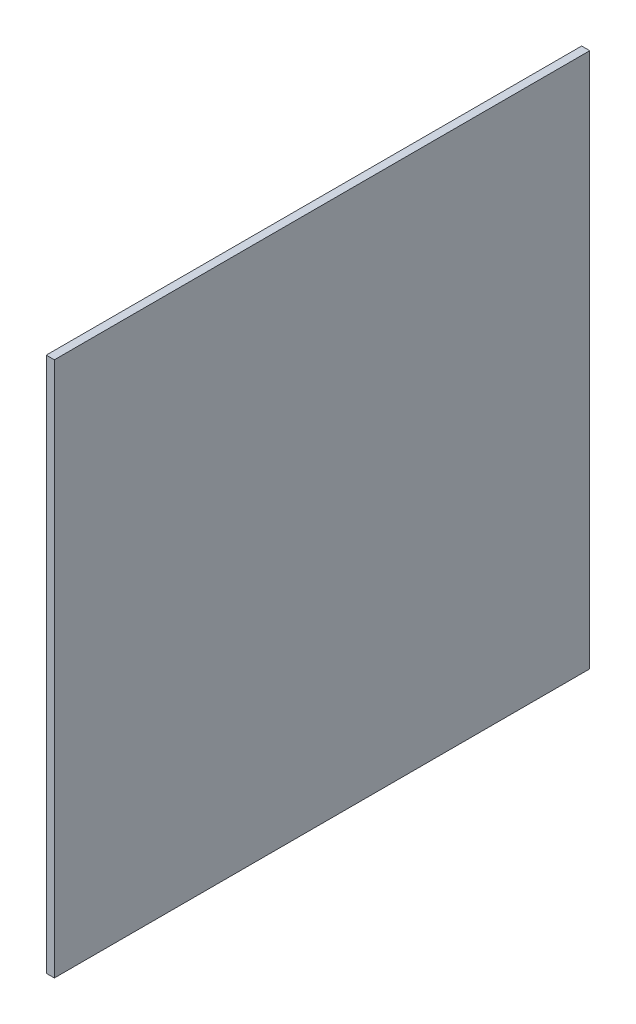
ISO-10303-21;
HEADER;
FILE_DESCRIPTION(('STEP AP214'),'2;1');
FILE_NAME('part.step','',(''),(''),'','','');
FILE_SCHEMA(('AUTOMOTIVE_DESIGN { 1 0 10303 214 1 1 1 1 }'));
ENDSEC;
DATA;
#1=APPLICATION_CONTEXT('core data for automotive mechanical design processes');
#2=APPLICATION_PROTOCOL_DEFINITION('international standard','automotive_design',2000,#1);
#3=PRODUCT_CONTEXT('',#1,'mechanical');
#4=PRODUCT('Part','Part','',(#3));
#5=PRODUCT_RELATED_PRODUCT_CATEGORY('part','',(#4));
#6=PRODUCT_DEFINITION_FORMATION('','',#4);
#7=PRODUCT_DEFINITION_CONTEXT('part definition',#1,'design');
#8=PRODUCT_DEFINITION('design','',#6,#7);
#9=PRODUCT_DEFINITION_SHAPE('','',#8);
#10=(LENGTH_UNIT() NAMED_UNIT(*) SI_UNIT(.MILLI.,.METRE.));
#11=(NAMED_UNIT(*) PLANE_ANGLE_UNIT() SI_UNIT($,.RADIAN.));
#12=(NAMED_UNIT(*) SI_UNIT($,.STERADIAN.) SOLID_ANGLE_UNIT());
#13=UNCERTAINTY_MEASURE_WITH_UNIT(LENGTH_MEASURE(1.E-05),#10,'distance_accuracy_value','');
#14=(GEOMETRIC_REPRESENTATION_CONTEXT(3) GLOBAL_UNCERTAINTY_ASSIGNED_CONTEXT((#13)) GLOBAL_UNIT_ASSIGNED_CONTEXT((#10,
#11,#12)) REPRESENTATION_CONTEXT('',''));
#15=CARTESIAN_POINT('',(0.,0.,0.));
#16=DIRECTION('',(0.,0.,1.));
#17=DIRECTION('',(1.,0.,0.));
#18=AXIS2_PLACEMENT_3D('',#15,#16,#17);
#19=CARTESIAN_POINT('',(-2.,-66.,66.));
#20=DIRECTION('',(0.,-1.,0.));
#21=DIRECTION('',(0.,0.,-1.));
#22=AXIS2_PLACEMENT_3D('',#19,#20,#21);
#23=PLANE('',#22);
#24=DIRECTION('',(0.,0.,-1.));
#25=VECTOR('',#24,1.);
#26=CARTESIAN_POINT('',(0.,-66.,66.));
#27=LINE('',#26,#25);
#28=CARTESIAN_POINT('',(0.,-66.,66.));
#29=VERTEX_POINT('',#28);
#30=CARTESIAN_POINT('',(0.,-66.,-66.));
#31=VERTEX_POINT('',#30);
#32=EDGE_CURVE('E85',#29,#31,#27,.T.);
#33=ORIENTED_EDGE('',*,*,#32,.F.);
#34=DIRECTION('',(1.,0.,0.));
#35=VECTOR('',#34,1.);
#36=CARTESIAN_POINT('',(-2.,-66.,66.));
#37=LINE('',#36,#35);
#38=CARTESIAN_POINT('',(-2.,-66.,66.));
#39=VERTEX_POINT('',#38);
#40=EDGE_CURVE('E34',#39,#29,#37,.T.);
#41=ORIENTED_EDGE('',*,*,#40,.F.);
#42=DIRECTION('',(0.,0.,-1.));
#43=VECTOR('',#42,1.);
#44=CARTESIAN_POINT('',(-2.,-66.,66.));
#45=LINE('',#44,#43);
#46=CARTESIAN_POINT('',(-2.,-66.,-66.));
#47=VERTEX_POINT('',#46);
#48=EDGE_CURVE('E73',#39,#47,#45,.T.);
#49=ORIENTED_EDGE('',*,*,#48,.T.);
#50=DIRECTION('',(1.,0.,0.));
#51=VECTOR('',#50,1.);
#52=CARTESIAN_POINT('',(-2.,-66.,-66.));
#53=LINE('',#52,#51);
#54=EDGE_CURVE('E11',#47,#31,#53,.T.);
#55=ORIENTED_EDGE('',*,*,#54,.T.);
#56=EDGE_LOOP('',(#33,#41,#49,#55));
#57=FACE_BOUND('',#56,.T.);
#58=ADVANCED_FACE('F18',(#57),#23,.T.);
#59=CARTESIAN_POINT('',(-2.,-66.,-66.));
#60=DIRECTION('',(0.,0.,-1.));
#61=DIRECTION('',(-1.,0.,0.));
#62=AXIS2_PLACEMENT_3D('',#59,#60,#61);
#63=PLANE('',#62);
#64=DIRECTION('',(0.,1.,0.));
#65=VECTOR('',#64,1.);
#66=CARTESIAN_POINT('',(0.,-66.,-66.));
#67=LINE('',#66,#65);
#68=CARTESIAN_POINT('',(0.,66.,-66.));
#69=VERTEX_POINT('',#68);
#70=EDGE_CURVE('E82',#31,#69,#67,.T.);
#71=ORIENTED_EDGE('',*,*,#70,.F.);
#72=ORIENTED_EDGE('',*,*,#54,.F.);
#73=DIRECTION('',(0.,1.,0.));
#74=VECTOR('',#73,1.);
#75=CARTESIAN_POINT('',(-2.,-66.,-66.));
#76=LINE('',#75,#74);
#77=CARTESIAN_POINT('',(-2.,66.,-66.));
#78=VERTEX_POINT('',#77);
#79=EDGE_CURVE('E69',#47,#78,#76,.T.);
#80=ORIENTED_EDGE('',*,*,#79,.T.);
#81=DIRECTION('',(1.,0.,0.));
#82=VECTOR('',#81,1.);
#83=CARTESIAN_POINT('',(-2.,66.,-66.));
#84=LINE('',#83,#82);
#85=EDGE_CURVE('E26',#78,#69,#84,.T.);
#86=ORIENTED_EDGE('',*,*,#85,.T.);
#87=EDGE_LOOP('',(#71,#72,#80,#86));
#88=FACE_BOUND('',#87,.T.);
#89=ADVANCED_FACE('F70',(#88),#63,.T.);
#90=CARTESIAN_POINT('',(-2.,66.,-66.));
#91=DIRECTION('',(0.,1.,0.));
#92=DIRECTION('',(0.,0.,1.));
#93=AXIS2_PLACEMENT_3D('',#90,#91,#92);
#94=PLANE('',#93);
#95=DIRECTION('',(0.,0.,1.));
#96=VECTOR('',#95,1.);
#97=CARTESIAN_POINT('',(0.,66.,-66.));
#98=LINE('',#97,#96);
#99=CARTESIAN_POINT('',(0.,66.,66.));
#100=VERTEX_POINT('',#99);
#101=EDGE_CURVE('E67',#69,#100,#98,.T.);
#102=ORIENTED_EDGE('',*,*,#101,.F.);
#103=ORIENTED_EDGE('',*,*,#85,.F.);
#104=DIRECTION('',(0.,0.,1.));
#105=VECTOR('',#104,1.);
#106=CARTESIAN_POINT('',(-2.,66.,-66.));
#107=LINE('',#106,#105);
#108=CARTESIAN_POINT('',(-2.,66.,66.));
#109=VERTEX_POINT('',#108);
#110=EDGE_CURVE('E64',#78,#109,#107,.T.);
#111=ORIENTED_EDGE('',*,*,#110,.T.);
#112=DIRECTION('',(1.,0.,0.));
#113=VECTOR('',#112,1.);
#114=CARTESIAN_POINT('',(-2.,66.,66.));
#115=LINE('',#114,#113);
#116=EDGE_CURVE('E50',#109,#100,#115,.T.);
#117=ORIENTED_EDGE('',*,*,#116,.T.);
#118=EDGE_LOOP('',(#102,#103,#111,#117));
#119=FACE_BOUND('',#118,.T.);
#120=ADVANCED_FACE('F62',(#119),#94,.T.);
#121=CARTESIAN_POINT('',(-2.,66.,66.));
#122=DIRECTION('',(0.,0.,1.));
#123=DIRECTION('',(1.,0.,0.));
#124=AXIS2_PLACEMENT_3D('',#121,#122,#123);
#125=PLANE('',#124);
#126=DIRECTION('',(0.,-1.,0.));
#127=VECTOR('',#126,1.);
#128=CARTESIAN_POINT('',(0.,66.,66.));
#129=LINE('',#128,#127);
#130=EDGE_CURVE('E81',#100,#29,#129,.T.);
#131=ORIENTED_EDGE('',*,*,#130,.F.);
#132=ORIENTED_EDGE('',*,*,#116,.F.);
#133=DIRECTION('',(0.,-1.,0.));
#134=VECTOR('',#133,1.);
#135=CARTESIAN_POINT('',(-2.,66.,66.));
#136=LINE('',#135,#134);
#137=EDGE_CURVE('E76',#109,#39,#136,.T.);
#138=ORIENTED_EDGE('',*,*,#137,.T.);
#139=ORIENTED_EDGE('',*,*,#40,.T.);
#140=EDGE_LOOP('',(#131,#132,#138,#139));
#141=FACE_BOUND('',#140,.T.);
#142=ADVANCED_FACE('F106',(#141),#125,.T.);
#143=CARTESIAN_POINT('',(-2.,-66.,-66.));
#144=DIRECTION('',(1.,0.,0.));
#145=DIRECTION('',(0.,1.,0.));
#146=AXIS2_PLACEMENT_3D('',#143,#144,#145);
#147=PLANE('',#146);
#148=ORIENTED_EDGE('',*,*,#48,.F.);
#149=ORIENTED_EDGE('',*,*,#137,.F.);
#150=ORIENTED_EDGE('',*,*,#110,.F.);
#151=ORIENTED_EDGE('',*,*,#79,.F.);
#152=EDGE_LOOP('',(#148,#149,#150,#151));
#153=FACE_BOUND('',#152,.T.);
#154=ADVANCED_FACE('F75',(#153),#147,.F.);
#155=CARTESIAN_POINT('',(0.,-66.,-66.));
#156=DIRECTION('',(1.,0.,0.));
#157=DIRECTION('',(0.,1.,0.));
#158=AXIS2_PLACEMENT_3D('',#155,#156,#157);
#159=PLANE('',#158);
#160=ORIENTED_EDGE('',*,*,#32,.T.);
#161=ORIENTED_EDGE('',*,*,#70,.T.);
#162=ORIENTED_EDGE('',*,*,#101,.T.);
#163=ORIENTED_EDGE('',*,*,#130,.T.);
#164=EDGE_LOOP('',(#160,#161,#162,#163));
#165=FACE_BOUND('',#164,.T.);
#166=ADVANCED_FACE('F97',(#165),#159,.T.);
#167=CLOSED_SHELL('',(#58,#89,#120,#142,#154,#166));
#168=MANIFOLD_SOLID_BREP('B1',#167);
#169=ADVANCED_BREP_SHAPE_REPRESENTATION('',(#18,#168),#14);
#170=SHAPE_DEFINITION_REPRESENTATION(#9,#169);
ENDSEC;
END-ISO-10303-21;
